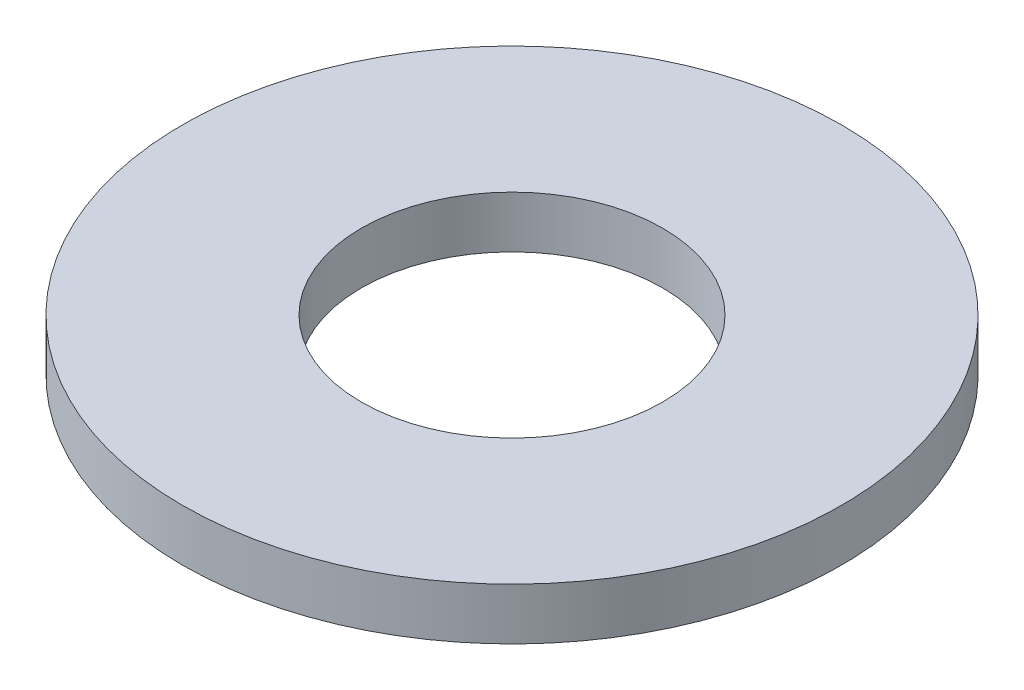
ISO-10303-21;
HEADER;
FILE_DESCRIPTION(('STEP AP214'),'2;1');
FILE_NAME('part.step','',(''),(''),'','','');
FILE_SCHEMA(('AUTOMOTIVE_DESIGN { 1 0 10303 214 1 1 1 1 }'));
ENDSEC;
DATA;
#1=APPLICATION_CONTEXT('core data for automotive mechanical design processes');
#2=APPLICATION_PROTOCOL_DEFINITION('international standard','automotive_design',2000,#1);
#3=PRODUCT_CONTEXT('',#1,'mechanical');
#4=PRODUCT('Part','Part','',(#3));
#5=PRODUCT_RELATED_PRODUCT_CATEGORY('part','',(#4));
#6=PRODUCT_DEFINITION_FORMATION('','',#4);
#7=PRODUCT_DEFINITION_CONTEXT('part definition',#1,'design');
#8=PRODUCT_DEFINITION('design','',#6,#7);
#9=PRODUCT_DEFINITION_SHAPE('','',#8);
#10=(LENGTH_UNIT() NAMED_UNIT(*) SI_UNIT(.MILLI.,.METRE.));
#11=(NAMED_UNIT(*) PLANE_ANGLE_UNIT() SI_UNIT($,.RADIAN.));
#12=(NAMED_UNIT(*) SI_UNIT($,.STERADIAN.) SOLID_ANGLE_UNIT());
#13=UNCERTAINTY_MEASURE_WITH_UNIT(LENGTH_MEASURE(1.E-05),#10,'distance_accuracy_value','');
#14=(GEOMETRIC_REPRESENTATION_CONTEXT(3) GLOBAL_UNCERTAINTY_ASSIGNED_CONTEXT((#13)) GLOBAL_UNIT_ASSIGNED_CONTEXT((#10,
#11,#12)) REPRESENTATION_CONTEXT('',''));
#15=CARTESIAN_POINT('',(0.,0.,0.));
#16=DIRECTION('',(0.,0.,1.));
#17=DIRECTION('',(1.,0.,0.));
#18=AXIS2_PLACEMENT_3D('',#15,#16,#17);
#19=CARTESIAN_POINT('',(0.,0.55,0.));
#20=DIRECTION('',(0.,1.,0.));
#21=DIRECTION('',(0.,0.,1.));
#22=AXIS2_PLACEMENT_3D('',#19,#20,#21);
#23=PLANE('',#22);
#24=CARTESIAN_POINT('',(0.,0.55,0.));
#25=DIRECTION('',(0.,1.,0.));
#26=DIRECTION('',(0.,0.,1.));
#27=AXIS2_PLACEMENT_3D('',#24,#25,#26);
#28=CIRCLE('',#27,3.5);
#29=CARTESIAN_POINT('',(0.,0.55,3.5));
#30=VERTEX_POINT('',#29);
#31=EDGE_CURVE('E10',#30,#30,#28,.T.);
#32=ORIENTED_EDGE('',*,*,#31,.T.);
#33=EDGE_LOOP('',(#32));
#34=FACE_BOUND('',#33,.T.);
#35=CARTESIAN_POINT('',(0.,0.55,0.));
#36=DIRECTION('',(0.,1.,0.));
#37=DIRECTION('',(0.,0.,1.));
#38=AXIS2_PLACEMENT_3D('',#35,#36,#37);
#39=CIRCLE('',#38,1.6);
#40=CARTESIAN_POINT('',(0.,0.55,1.6));
#41=VERTEX_POINT('',#40);
#42=EDGE_CURVE('E42',#41,#41,#39,.T.);
#43=ORIENTED_EDGE('',*,*,#42,.F.);
#44=EDGE_LOOP('',(#43));
#45=FACE_BOUND('',#44,.T.);
#46=ADVANCED_FACE('F31',(#34,#45),#23,.T.);
#47=CARTESIAN_POINT('',(0.,0.,0.));
#48=DIRECTION('',(0.,1.,0.));
#49=DIRECTION('',(0.,0.,1.));
#50=AXIS2_PLACEMENT_3D('',#47,#48,#49);
#51=PLANE('',#50);
#52=CARTESIAN_POINT('',(0.,0.,0.));
#53=DIRECTION('',(0.,1.,0.));
#54=DIRECTION('',(0.,0.,1.));
#55=AXIS2_PLACEMENT_3D('',#52,#53,#54);
#56=CIRCLE('',#55,3.5);
#57=CARTESIAN_POINT('',(0.,0.,3.5));
#58=VERTEX_POINT('',#57);
#59=EDGE_CURVE('E35',#58,#58,#56,.T.);
#60=ORIENTED_EDGE('',*,*,#59,.F.);
#61=EDGE_LOOP('',(#60));
#62=FACE_BOUND('',#61,.T.);
#63=CARTESIAN_POINT('',(0.,0.,0.));
#64=DIRECTION('',(0.,1.,0.));
#65=DIRECTION('',(0.,0.,1.));
#66=AXIS2_PLACEMENT_3D('',#63,#64,#65);
#67=CIRCLE('',#66,1.6);
#68=CARTESIAN_POINT('',(0.,0.,1.6));
#69=VERTEX_POINT('',#68);
#70=EDGE_CURVE('E44',#69,#69,#67,.T.);
#71=ORIENTED_EDGE('',*,*,#70,.T.);
#72=EDGE_LOOP('',(#71));
#73=FACE_BOUND('',#72,.T.);
#74=ADVANCED_FACE('F54',(#62,#73),#51,.F.);
#75=CARTESIAN_POINT('',(0.,0.55,0.));
#76=DIRECTION('',(0.,-1.,0.));
#77=DIRECTION('',(0.,0.,-1.));
#78=AXIS2_PLACEMENT_3D('',#75,#76,#77);
#79=CYLINDRICAL_SURFACE('',#78,3.5);
#80=ORIENTED_EDGE('',*,*,#31,.F.);
#81=EDGE_LOOP('',(#80));
#82=FACE_BOUND('',#81,.T.);
#83=ORIENTED_EDGE('',*,*,#59,.T.);
#84=EDGE_LOOP('',(#83));
#85=FACE_BOUND('',#84,.T.);
#86=ADVANCED_FACE('F33',(#82,#85),#79,.T.);
#87=CARTESIAN_POINT('',(0.,0.55,0.));
#88=DIRECTION('',(0.,-1.,0.));
#89=DIRECTION('',(0.,0.,-1.));
#90=AXIS2_PLACEMENT_3D('',#87,#88,#89);
#91=CYLINDRICAL_SURFACE('',#90,1.6);
#92=ORIENTED_EDGE('',*,*,#42,.T.);
#93=EDGE_LOOP('',(#92));
#94=FACE_BOUND('',#93,.T.);
#95=ORIENTED_EDGE('',*,*,#70,.F.);
#96=EDGE_LOOP('',(#95));
#97=FACE_BOUND('',#96,.T.);
#98=ADVANCED_FACE('F50',(#94,#97),#91,.F.);
#99=CLOSED_SHELL('',(#46,#74,#86,#98));
#100=MANIFOLD_SOLID_BREP('B2',#99);
#101=ADVANCED_BREP_SHAPE_REPRESENTATION('',(#18,#100),#14);
#102=SHAPE_DEFINITION_REPRESENTATION(#9,#101);
ENDSEC;
END-ISO-10303-21;
